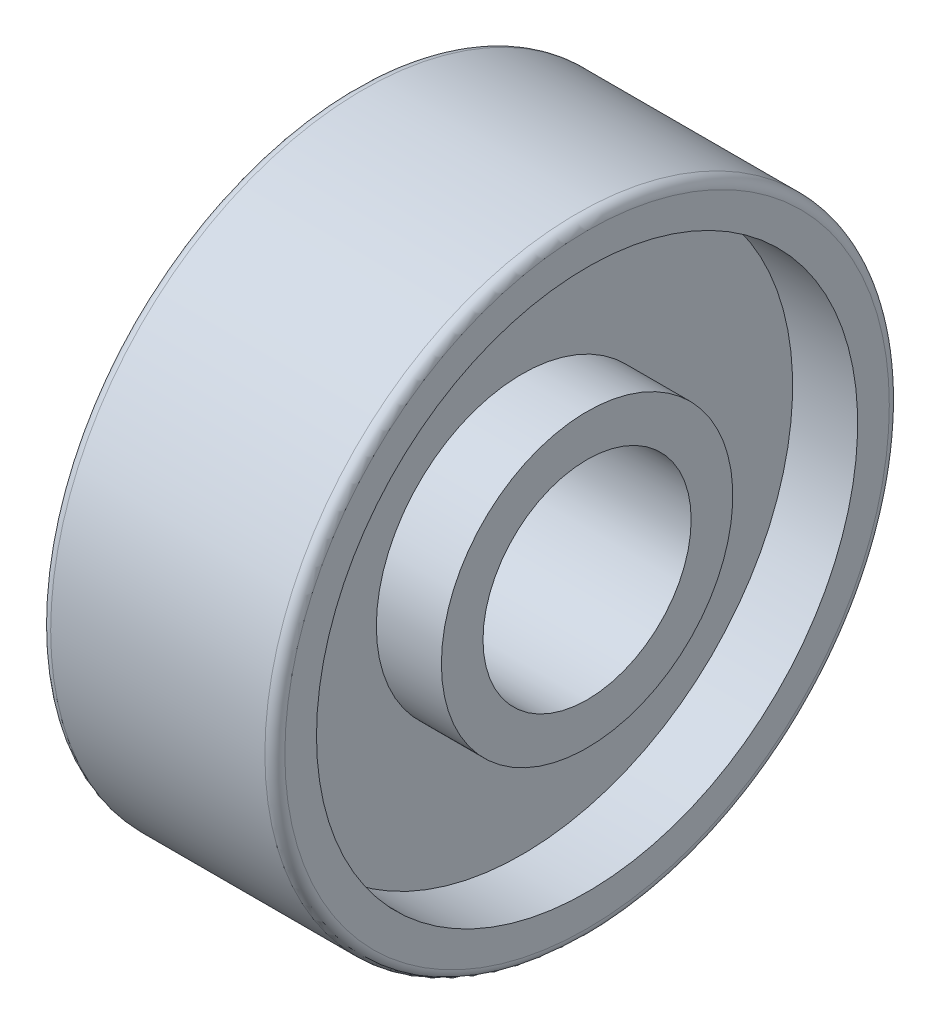
ISO-10303-21;
HEADER;
FILE_DESCRIPTION(('STEP AP214'),'2;1');
FILE_NAME('part.step','',(''),(''),'','','');
FILE_SCHEMA(('AUTOMOTIVE_DESIGN { 1 0 10303 214 1 1 1 1 }'));
ENDSEC;
DATA;
#1=APPLICATION_CONTEXT('core data for automotive mechanical design processes');
#2=APPLICATION_PROTOCOL_DEFINITION('international standard','automotive_design',2000,#1);
#3=PRODUCT_CONTEXT('',#1,'mechanical');
#4=PRODUCT('Part','Part','',(#3));
#5=PRODUCT_RELATED_PRODUCT_CATEGORY('part','',(#4));
#6=PRODUCT_DEFINITION_FORMATION('','',#4);
#7=PRODUCT_DEFINITION_CONTEXT('part definition',#1,'design');
#8=PRODUCT_DEFINITION('design','',#6,#7);
#9=PRODUCT_DEFINITION_SHAPE('','',#8);
#10=(LENGTH_UNIT() NAMED_UNIT(*) SI_UNIT(.MILLI.,.METRE.));
#11=(NAMED_UNIT(*) PLANE_ANGLE_UNIT() SI_UNIT($,.RADIAN.));
#12=(NAMED_UNIT(*) SI_UNIT($,.STERADIAN.) SOLID_ANGLE_UNIT());
#13=UNCERTAINTY_MEASURE_WITH_UNIT(LENGTH_MEASURE(1.E-05),#10,'distance_accuracy_value','');
#14=(GEOMETRIC_REPRESENTATION_CONTEXT(3) GLOBAL_UNCERTAINTY_ASSIGNED_CONTEXT((#13)) GLOBAL_UNIT_ASSIGNED_CONTEXT((#10,
#11,#12)) REPRESENTATION_CONTEXT('',''));
#15=CARTESIAN_POINT('',(0.,0.,0.));
#16=DIRECTION('',(0.,0.,1.));
#17=DIRECTION('',(1.,0.,0.));
#18=AXIS2_PLACEMENT_3D('',#15,#16,#17);
#19=CARTESIAN_POINT('',(7.14375,3.175,0.));
#20=DIRECTION('',(-1.,0.,0.));
#21=DIRECTION('',(0.,0.,1.));
#22=AXIS2_PLACEMENT_3D('',#19,#20,#21);
#23=PLANE('',#22);
#24=CARTESIAN_POINT('',(7.14375,0.,0.));
#25=DIRECTION('',(-1.,0.,0.));
#26=DIRECTION('',(0.,0.,1.));
#27=AXIS2_PLACEMENT_3D('',#24,#25,#26);
#28=CIRCLE('',#27,4.445);
#29=CARTESIAN_POINT('',(7.14375,0.,4.445));
#30=VERTEX_POINT('',#29);
#31=EDGE_CURVE('E10',#30,#30,#28,.T.);
#32=ORIENTED_EDGE('',*,*,#31,.F.);
#33=EDGE_LOOP('',(#32));
#34=FACE_BOUND('',#33,.T.);
#35=CARTESIAN_POINT('',(7.14375,0.,0.));
#36=DIRECTION('',(-1.,0.,0.));
#37=DIRECTION('',(0.,0.,1.));
#38=AXIS2_PLACEMENT_3D('',#35,#36,#37);
#39=CIRCLE('',#38,3.175);
#40=CARTESIAN_POINT('',(7.14375,0.,3.175));
#41=VERTEX_POINT('',#40);
#42=EDGE_CURVE('E82',#41,#41,#39,.T.);
#43=ORIENTED_EDGE('',*,*,#42,.T.);
#44=EDGE_LOOP('',(#43));
#45=FACE_BOUND('',#44,.T.);
#46=ADVANCED_FACE('F33',(#34,#45),#23,.F.);
#47=CARTESIAN_POINT('',(-4.8320583682069,0.,0.));
#48=DIRECTION('',(-1.,0.,0.));
#49=DIRECTION('',(0.,0.,1.));
#50=AXIS2_PLACEMENT_3D('',#47,#48,#49);
#51=CYLINDRICAL_SURFACE('',#50,4.445);
#52=CARTESIAN_POINT('',(5.159375,0.,0.));
#53=DIRECTION('',(-1.,0.,0.));
#54=DIRECTION('',(0.,0.,1.));
#55=AXIS2_PLACEMENT_3D('',#52,#53,#54);
#56=CIRCLE('',#55,4.445);
#57=CARTESIAN_POINT('',(5.159375,0.,4.445));
#58=VERTEX_POINT('',#57);
#59=EDGE_CURVE('E39',#58,#58,#56,.T.);
#60=ORIENTED_EDGE('',*,*,#59,.F.);
#61=EDGE_LOOP('',(#60));
#62=FACE_BOUND('',#61,.T.);
#63=ORIENTED_EDGE('',*,*,#31,.T.);
#64=EDGE_LOOP('',(#63));
#65=FACE_BOUND('',#64,.T.);
#66=ADVANCED_FACE('F161',(#62,#65),#51,.T.);
#67=CARTESIAN_POINT('',(5.159375,4.445,0.));
#68=DIRECTION('',(-1.,0.,0.));
#69=DIRECTION('',(0.,0.,1.));
#70=AXIS2_PLACEMENT_3D('',#67,#68,#69);
#71=PLANE('',#70);
#72=CARTESIAN_POINT('',(5.159375,0.,0.));
#73=DIRECTION('',(-1.,0.,0.));
#74=DIRECTION('',(0.,0.,1.));
#75=AXIS2_PLACEMENT_3D('',#72,#73,#74);
#76=CIRCLE('',#75,8.255);
#77=CARTESIAN_POINT('',(5.159375,0.,8.255));
#78=VERTEX_POINT('',#77);
#79=EDGE_CURVE('E43',#78,#78,#76,.T.);
#80=ORIENTED_EDGE('',*,*,#79,.F.);
#81=EDGE_LOOP('',(#80));
#82=FACE_BOUND('',#81,.T.);
#83=ORIENTED_EDGE('',*,*,#59,.T.);
#84=EDGE_LOOP('',(#83));
#85=FACE_BOUND('',#84,.T.);
#86=ADVANCED_FACE('F156',(#82,#85),#71,.F.);
#87=CARTESIAN_POINT('',(-4.8320583682069,0.,0.));
#88=DIRECTION('',(-1.,0.,0.));
#89=DIRECTION('',(0.,0.,1.));
#90=AXIS2_PLACEMENT_3D('',#87,#88,#89);
#91=CYLINDRICAL_SURFACE('',#90,8.255);
#92=CARTESIAN_POINT('',(7.14375,0.,0.));
#93=DIRECTION('',(-1.,0.,0.));
#94=DIRECTION('',(0.,0.,1.));
#95=AXIS2_PLACEMENT_3D('',#92,#93,#94);
#96=CIRCLE('',#95,8.255);
#97=CARTESIAN_POINT('',(7.14375,0.,8.255));
#98=VERTEX_POINT('',#97);
#99=EDGE_CURVE('E47',#98,#98,#96,.T.);
#100=ORIENTED_EDGE('',*,*,#99,.F.);
#101=EDGE_LOOP('',(#100));
#102=FACE_BOUND('',#101,.T.);
#103=ORIENTED_EDGE('',*,*,#79,.T.);
#104=EDGE_LOOP('',(#103));
#105=FACE_BOUND('',#104,.T.);
#106=ADVANCED_FACE('F150',(#102,#105),#91,.F.);
#107=CARTESIAN_POINT('',(7.14375,8.255,0.));
#108=DIRECTION('',(-1.,0.,0.));
#109=DIRECTION('',(0.,0.,1.));
#110=AXIS2_PLACEMENT_3D('',#107,#108,#109);
#111=PLANE('',#110);
#112=CARTESIAN_POINT('',(7.14375,0.,0.));
#113=DIRECTION('',(-1.,0.,0.));
#114=DIRECTION('',(0.,0.,1.));
#115=AXIS2_PLACEMENT_3D('',#112,#113,#114);
#116=CIRCLE('',#115,9.2202);
#117=CARTESIAN_POINT('',(7.14375,0.,9.2202));
#118=VERTEX_POINT('',#117);
#119=EDGE_CURVE('E52',#118,#118,#116,.T.);
#120=ORIENTED_EDGE('',*,*,#119,.F.);
#121=EDGE_LOOP('',(#120));
#122=FACE_BOUND('',#121,.T.);
#123=ORIENTED_EDGE('',*,*,#99,.T.);
#124=EDGE_LOOP('',(#123));
#125=FACE_BOUND('',#124,.T.);
#126=ADVANCED_FACE('F144',(#122,#125),#111,.F.);
#127=CARTESIAN_POINT('',(6.83895,0.,0.));
#128=DIRECTION('',(-1.,0.,0.));
#129=DIRECTION('',(0.,0.,1.));
#130=AXIS2_PLACEMENT_3D('',#127,#128,#129);
#131=TOROIDAL_SURFACE('',#130,9.2202,0.3048);
#132=CARTESIAN_POINT('',(6.83895,0.,0.));
#133=DIRECTION('',(-1.,0.,0.));
#134=DIRECTION('',(0.,0.,1.));
#135=AXIS2_PLACEMENT_3D('',#132,#133,#134);
#136=CIRCLE('',#135,9.525);
#137=CARTESIAN_POINT('',(6.83895,0.,9.525));
#138=VERTEX_POINT('',#137);
#139=EDGE_CURVE('E55',#138,#138,#136,.T.);
#140=ORIENTED_EDGE('',*,*,#139,.F.);
#141=EDGE_LOOP('',(#140));
#142=FACE_BOUND('',#141,.T.);
#143=ORIENTED_EDGE('',*,*,#119,.T.);
#144=EDGE_LOOP('',(#143));
#145=FACE_BOUND('',#144,.T.);
#146=ADVANCED_FACE('F138',(#142,#145),#131,.T.);
#147=CARTESIAN_POINT('',(-4.8320583682069,0.,0.));
#148=DIRECTION('',(-1.,0.,0.));
#149=DIRECTION('',(0.,0.,1.));
#150=AXIS2_PLACEMENT_3D('',#147,#148,#149);
#151=CYLINDRICAL_SURFACE('',#150,9.525);
#152=CARTESIAN_POINT('',(0.304799999999999,0.,0.));
#153=DIRECTION('',(-1.,0.,0.));
#154=DIRECTION('',(0.,0.,1.));
#155=AXIS2_PLACEMENT_3D('',#152,#153,#154);
#156=CIRCLE('',#155,9.525);
#157=CARTESIAN_POINT('',(0.304799999999999,0.,9.525));
#158=VERTEX_POINT('',#157);
#159=EDGE_CURVE('E58',#158,#158,#156,.T.);
#160=ORIENTED_EDGE('',*,*,#159,.F.);
#161=EDGE_LOOP('',(#160));
#162=FACE_BOUND('',#161,.T.);
#163=ORIENTED_EDGE('',*,*,#139,.T.);
#164=EDGE_LOOP('',(#163));
#165=FACE_BOUND('',#164,.T.);
#166=ADVANCED_FACE('F132',(#162,#165),#151,.T.);
#167=CARTESIAN_POINT('',(0.304799999999999,0.,0.));
#168=DIRECTION('',(-1.,0.,0.));
#169=DIRECTION('',(0.,0.,1.));
#170=AXIS2_PLACEMENT_3D('',#167,#168,#169);
#171=TOROIDAL_SURFACE('',#170,9.2202,0.3048);
#172=CARTESIAN_POINT('',(0.,0.,0.));
#173=DIRECTION('',(-1.,0.,0.));
#174=DIRECTION('',(0.,0.,1.));
#175=AXIS2_PLACEMENT_3D('',#172,#173,#174);
#176=CIRCLE('',#175,9.2202);
#177=CARTESIAN_POINT('',(0.,0.,9.2202));
#178=VERTEX_POINT('',#177);
#179=EDGE_CURVE('E61',#178,#178,#176,.T.);
#180=ORIENTED_EDGE('',*,*,#179,.F.);
#181=EDGE_LOOP('',(#180));
#182=FACE_BOUND('',#181,.T.);
#183=ORIENTED_EDGE('',*,*,#159,.T.);
#184=EDGE_LOOP('',(#183));
#185=FACE_BOUND('',#184,.T.);
#186=ADVANCED_FACE('F126',(#182,#185),#171,.T.);
#187=CARTESIAN_POINT('',(0.,9.2202,0.));
#188=DIRECTION('',(1.,0.,0.));
#189=DIRECTION('',(0.,0.,-1.));
#190=AXIS2_PLACEMENT_3D('',#187,#188,#189);
#191=PLANE('',#190);
#192=CARTESIAN_POINT('',(0.,0.,0.));
#193=DIRECTION('',(-1.,0.,0.));
#194=DIRECTION('',(0.,0.,1.));
#195=AXIS2_PLACEMENT_3D('',#192,#193,#194);
#196=CIRCLE('',#195,8.255);
#197=CARTESIAN_POINT('',(0.,0.,8.255));
#198=VERTEX_POINT('',#197);
#199=EDGE_CURVE('E64',#198,#198,#196,.T.);
#200=ORIENTED_EDGE('',*,*,#199,.F.);
#201=EDGE_LOOP('',(#200));
#202=FACE_BOUND('',#201,.T.);
#203=ORIENTED_EDGE('',*,*,#179,.T.);
#204=EDGE_LOOP('',(#203));
#205=FACE_BOUND('',#204,.T.);
#206=ADVANCED_FACE('F120',(#202,#205),#191,.F.);
#207=CARTESIAN_POINT('',(-4.8320583682069,0.,0.));
#208=DIRECTION('',(-1.,0.,0.));
#209=DIRECTION('',(0.,0.,1.));
#210=AXIS2_PLACEMENT_3D('',#207,#208,#209);
#211=CYLINDRICAL_SURFACE('',#210,8.255);
#212=CARTESIAN_POINT('',(1.984375,0.,0.));
#213=DIRECTION('',(-1.,0.,0.));
#214=DIRECTION('',(0.,0.,1.));
#215=AXIS2_PLACEMENT_3D('',#212,#213,#214);
#216=CIRCLE('',#215,8.255);
#217=CARTESIAN_POINT('',(1.984375,0.,8.255));
#218=VERTEX_POINT('',#217);
#219=EDGE_CURVE('E67',#218,#218,#216,.T.);
#220=ORIENTED_EDGE('',*,*,#219,.F.);
#221=EDGE_LOOP('',(#220));
#222=FACE_BOUND('',#221,.T.);
#223=ORIENTED_EDGE('',*,*,#199,.T.);
#224=EDGE_LOOP('',(#223));
#225=FACE_BOUND('',#224,.T.);
#226=ADVANCED_FACE('F114',(#222,#225),#211,.F.);
#227=CARTESIAN_POINT('',(1.984375,8.255,0.));
#228=DIRECTION('',(1.,0.,0.));
#229=DIRECTION('',(0.,0.,-1.));
#230=AXIS2_PLACEMENT_3D('',#227,#228,#229);
#231=PLANE('',#230);
#232=CARTESIAN_POINT('',(1.984375,0.,0.));
#233=DIRECTION('',(-1.,0.,0.));
#234=DIRECTION('',(0.,0.,1.));
#235=AXIS2_PLACEMENT_3D('',#232,#233,#234);
#236=CIRCLE('',#235,4.445);
#237=CARTESIAN_POINT('',(1.984375,0.,4.445));
#238=VERTEX_POINT('',#237);
#239=EDGE_CURVE('E70',#238,#238,#236,.T.);
#240=ORIENTED_EDGE('',*,*,#239,.F.);
#241=EDGE_LOOP('',(#240));
#242=FACE_BOUND('',#241,.T.);
#243=ORIENTED_EDGE('',*,*,#219,.T.);
#244=EDGE_LOOP('',(#243));
#245=FACE_BOUND('',#244,.T.);
#246=ADVANCED_FACE('F108',(#242,#245),#231,.F.);
#247=CARTESIAN_POINT('',(-4.8320583682069,0.,0.));
#248=DIRECTION('',(-1.,0.,0.));
#249=DIRECTION('',(0.,0.,1.));
#250=AXIS2_PLACEMENT_3D('',#247,#248,#249);
#251=CYLINDRICAL_SURFACE('',#250,4.445);
#252=CARTESIAN_POINT('',(0.,0.,0.));
#253=DIRECTION('',(-1.,0.,0.));
#254=DIRECTION('',(0.,0.,1.));
#255=AXIS2_PLACEMENT_3D('',#252,#253,#254);
#256=CIRCLE('',#255,4.445);
#257=CARTESIAN_POINT('',(0.,0.,4.445));
#258=VERTEX_POINT('',#257);
#259=EDGE_CURVE('E73',#258,#258,#256,.T.);
#260=ORIENTED_EDGE('',*,*,#259,.F.);
#261=EDGE_LOOP('',(#260));
#262=FACE_BOUND('',#261,.T.);
#263=ORIENTED_EDGE('',*,*,#239,.T.);
#264=EDGE_LOOP('',(#263));
#265=FACE_BOUND('',#264,.T.);
#266=ADVANCED_FACE('F102',(#262,#265),#251,.T.);
#267=CARTESIAN_POINT('',(0.,4.445,0.));
#268=DIRECTION('',(1.,0.,0.));
#269=DIRECTION('',(0.,0.,-1.));
#270=AXIS2_PLACEMENT_3D('',#267,#268,#269);
#271=PLANE('',#270);
#272=CARTESIAN_POINT('',(0.,0.,0.));
#273=DIRECTION('',(-1.,0.,0.));
#274=DIRECTION('',(0.,0.,1.));
#275=AXIS2_PLACEMENT_3D('',#272,#273,#274);
#276=CIRCLE('',#275,3.4798);
#277=CARTESIAN_POINT('',(0.,0.,3.4798));
#278=VERTEX_POINT('',#277);
#279=EDGE_CURVE('E76',#278,#278,#276,.T.);
#280=ORIENTED_EDGE('',*,*,#279,.F.);
#281=EDGE_LOOP('',(#280));
#282=FACE_BOUND('',#281,.T.);
#283=ORIENTED_EDGE('',*,*,#259,.T.);
#284=EDGE_LOOP('',(#283));
#285=FACE_BOUND('',#284,.T.);
#286=ADVANCED_FACE('F96',(#282,#285),#271,.F.);
#287=CARTESIAN_POINT('',(0.3048,0.,0.));
#288=DIRECTION('',(-1.,0.,0.));
#289=DIRECTION('',(0.,0.,1.));
#290=AXIS2_PLACEMENT_3D('',#287,#288,#289);
#291=TOROIDAL_SURFACE('',#290,3.4798,0.3048);
#292=CARTESIAN_POINT('',(0.3048,0.,0.));
#293=DIRECTION('',(-1.,0.,0.));
#294=DIRECTION('',(0.,0.,1.));
#295=AXIS2_PLACEMENT_3D('',#292,#293,#294);
#296=CIRCLE('',#295,3.175);
#297=CARTESIAN_POINT('',(0.3048,0.,3.175));
#298=VERTEX_POINT('',#297);
#299=EDGE_CURVE('E79',#298,#298,#296,.T.);
#300=ORIENTED_EDGE('',*,*,#299,.F.);
#301=EDGE_LOOP('',(#300));
#302=FACE_BOUND('',#301,.T.);
#303=ORIENTED_EDGE('',*,*,#279,.T.);
#304=EDGE_LOOP('',(#303));
#305=FACE_BOUND('',#304,.T.);
#306=ADVANCED_FACE('F90',(#302,#305),#291,.T.);
#307=CARTESIAN_POINT('',(-4.8320583682069,0.,0.));
#308=DIRECTION('',(-1.,0.,0.));
#309=DIRECTION('',(0.,0.,1.));
#310=AXIS2_PLACEMENT_3D('',#307,#308,#309);
#311=CYLINDRICAL_SURFACE('',#310,3.175);
#312=ORIENTED_EDGE('',*,*,#42,.F.);
#313=EDGE_LOOP('',(#312));
#314=FACE_BOUND('',#313,.T.);
#315=ORIENTED_EDGE('',*,*,#299,.T.);
#316=EDGE_LOOP('',(#315));
#317=FACE_BOUND('',#316,.T.);
#318=ADVANCED_FACE('F87',(#314,#317),#311,.F.);
#319=CLOSED_SHELL('',(#46,#66,#86,#106,#126,#146,#166,#186,#206,#226,#246,#266,#286,#306,#318));
#320=MANIFOLD_SOLID_BREP('B2',#319);
#321=ADVANCED_BREP_SHAPE_REPRESENTATION('',(#18,#320),#14);
#322=SHAPE_DEFINITION_REPRESENTATION(#9,#321);
ENDSEC;
END-ISO-10303-21;
